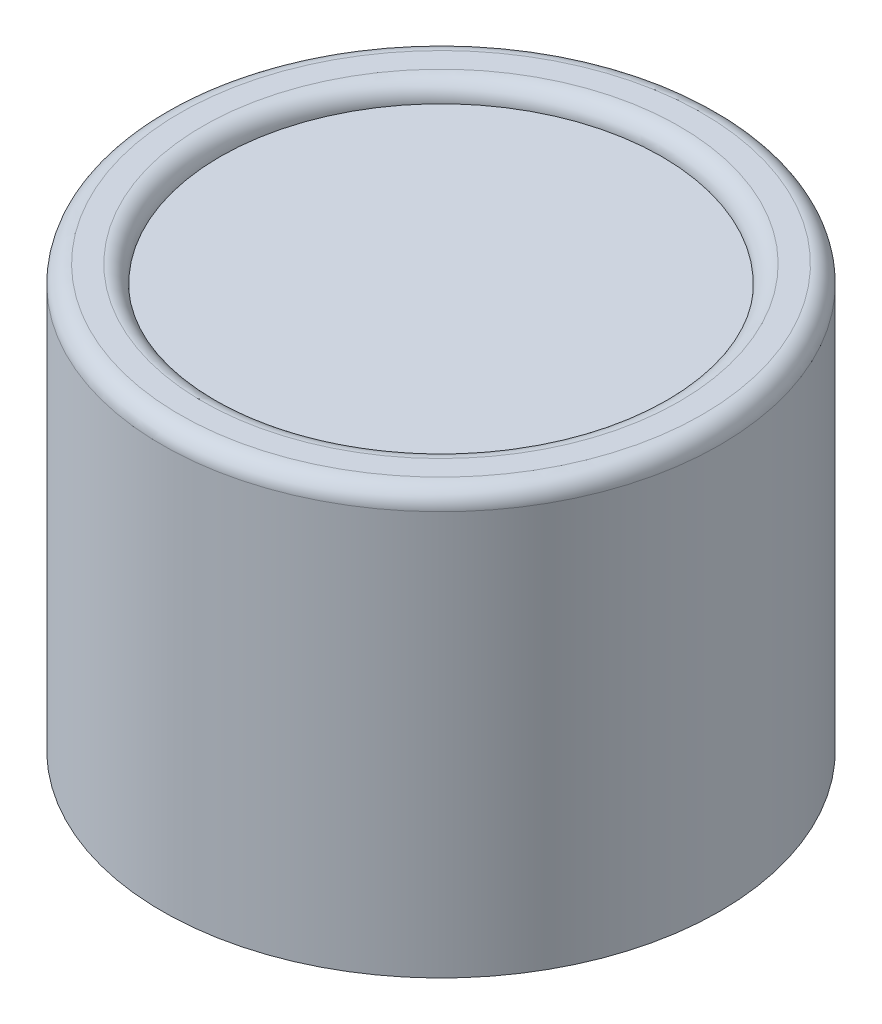
ISO-10303-21;
HEADER;
FILE_DESCRIPTION(('STEP AP214'),'2;1');
FILE_NAME('part.step','',(''),(''),'','','');
FILE_SCHEMA(('AUTOMOTIVE_DESIGN { 1 0 10303 214 1 1 1 1 }'));
ENDSEC;
DATA;
#1=APPLICATION_CONTEXT('core data for automotive mechanical design processes');
#2=APPLICATION_PROTOCOL_DEFINITION('international standard','automotive_design',2000,#1);
#3=PRODUCT_CONTEXT('',#1,'mechanical');
#4=PRODUCT('Part','Part','',(#3));
#5=PRODUCT_RELATED_PRODUCT_CATEGORY('part','',(#4));
#6=PRODUCT_DEFINITION_FORMATION('','',#4);
#7=PRODUCT_DEFINITION_CONTEXT('part definition',#1,'design');
#8=PRODUCT_DEFINITION('design','',#6,#7);
#9=PRODUCT_DEFINITION_SHAPE('','',#8);
#10=(LENGTH_UNIT() NAMED_UNIT(*) SI_UNIT(.MILLI.,.METRE.));
#11=(NAMED_UNIT(*) PLANE_ANGLE_UNIT() SI_UNIT($,.RADIAN.));
#12=(NAMED_UNIT(*) SI_UNIT($,.STERADIAN.) SOLID_ANGLE_UNIT());
#13=UNCERTAINTY_MEASURE_WITH_UNIT(LENGTH_MEASURE(1.E-05),#10,'distance_accuracy_value','');
#14=(GEOMETRIC_REPRESENTATION_CONTEXT(3) GLOBAL_UNCERTAINTY_ASSIGNED_CONTEXT((#13)) GLOBAL_UNIT_ASSIGNED_CONTEXT((#10,
#11,#12)) REPRESENTATION_CONTEXT('',''));
#15=CARTESIAN_POINT('',(0.,0.,0.));
#16=DIRECTION('',(0.,0.,1.));
#17=DIRECTION('',(1.,0.,0.));
#18=AXIS2_PLACEMENT_3D('',#15,#16,#17);
#19=CARTESIAN_POINT('',(6.29,0.,0.));
#20=DIRECTION('',(0.,-1.,0.));
#21=DIRECTION('',(1.,0.,0.));
#22=AXIS2_PLACEMENT_3D('',#19,#20,#21);
#23=PLANE('',#22);
#24=CARTESIAN_POINT('',(0.,0.,0.));
#25=DIRECTION('',(0.,1.,0.));
#26=DIRECTION('',(-1.,0.,0.));
#27=AXIS2_PLACEMENT_3D('',#24,#25,#26);
#28=CIRCLE('',#27,6.29);
#29=CARTESIAN_POINT('',(-6.29,0.,0.));
#30=VERTEX_POINT('',#29);
#31=EDGE_CURVE('E34',#30,#30,#28,.T.);
#32=ORIENTED_EDGE('',*,*,#31,.T.);
#33=EDGE_LOOP('',(#32));
#34=FACE_BOUND('',#33,.T.);
#35=ADVANCED_FACE('F14',(#34),#23,.F.);
#36=CARTESIAN_POINT('',(0.,-11.5,0.));
#37=DIRECTION('',(0.,1.,0.));
#38=DIRECTION('',(-1.,0.,0.));
#39=AXIS2_PLACEMENT_3D('',#36,#37,#38);
#40=PLANE('',#39);
#41=CARTESIAN_POINT('',(0.,-11.5,0.));
#42=DIRECTION('',(0.,1.,0.));
#43=DIRECTION('',(-1.,0.,0.));
#44=AXIS2_PLACEMENT_3D('',#41,#42,#43);
#45=CIRCLE('',#44,7.94);
#46=CARTESIAN_POINT('',(-7.94,-11.5,0.));
#47=VERTEX_POINT('',#46);
#48=EDGE_CURVE('E29',#47,#47,#45,.T.);
#49=ORIENTED_EDGE('',*,*,#48,.F.);
#50=EDGE_LOOP('',(#49));
#51=FACE_BOUND('',#50,.T.);
#52=ADVANCED_FACE('F54',(#51),#40,.F.);
#53=CARTESIAN_POINT('',(0.,0.,0.));
#54=DIRECTION('',(0.,1.,0.));
#55=DIRECTION('',(-1.,0.,0.));
#56=AXIS2_PLACEMENT_3D('',#53,#54,#55);
#57=CYLINDRICAL_SURFACE('',#56,7.94);
#58=CARTESIAN_POINT('',(0.,0.,0.));
#59=DIRECTION('',(0.,-1.,0.));
#60=DIRECTION('',(1.,0.,0.));
#61=AXIS2_PLACEMENT_3D('',#58,#59,#60);
#62=CIRCLE('',#61,7.94);
#63=CARTESIAN_POINT('',(7.94,0.,0.));
#64=VERTEX_POINT('',#63);
#65=EDGE_CURVE('E10',#64,#64,#62,.T.);
#66=ORIENTED_EDGE('',*,*,#65,.T.);
#67=EDGE_LOOP('',(#66));
#68=FACE_BOUND('',#67,.T.);
#69=ORIENTED_EDGE('',*,*,#48,.T.);
#70=EDGE_LOOP('',(#69));
#71=FACE_BOUND('',#70,.T.);
#72=ADVANCED_FACE('F50',(#68,#71),#57,.T.);
#73=CARTESIAN_POINT('',(7.94,0.5,0.));
#74=DIRECTION('',(0.,-1.,0.));
#75=DIRECTION('',(1.,0.,0.));
#76=AXIS2_PLACEMENT_3D('',#73,#74,#75);
#77=PLANE('',#76);
#78=CARTESIAN_POINT('',(0.,0.5,0.));
#79=DIRECTION('',(0.,-1.,0.));
#80=DIRECTION('',(1.,0.,0.));
#81=AXIS2_PLACEMENT_3D('',#78,#79,#80);
#82=CIRCLE('',#81,6.79);
#83=CARTESIAN_POINT('',(6.79,0.500000000000001,0.));
#84=VERTEX_POINT('',#83);
#85=EDGE_CURVE('E21',#84,#84,#82,.T.);
#86=ORIENTED_EDGE('',*,*,#85,.T.);
#87=EDGE_LOOP('',(#86));
#88=FACE_BOUND('',#87,.T.);
#89=CARTESIAN_POINT('',(0.,0.5,0.));
#90=DIRECTION('',(0.,-1.,0.));
#91=DIRECTION('',(1.,0.,0.));
#92=AXIS2_PLACEMENT_3D('',#89,#90,#91);
#93=CIRCLE('',#92,7.44);
#94=CARTESIAN_POINT('',(7.44,0.500000000000001,0.));
#95=VERTEX_POINT('',#94);
#96=EDGE_CURVE('E25',#95,#95,#93,.F.);
#97=ORIENTED_EDGE('',*,*,#96,.T.);
#98=EDGE_LOOP('',(#97));
#99=FACE_BOUND('',#98,.T.);
#100=ADVANCED_FACE('F41',(#88,#99),#77,.F.);
#101=CARTESIAN_POINT('',(0.,0.,0.));
#102=DIRECTION('',(0.,-1.,0.));
#103=DIRECTION('',(1.,0.,0.));
#104=AXIS2_PLACEMENT_3D('',#101,#102,#103);
#105=TOROIDAL_SURFACE('',#104,6.79,0.5);
#106=ORIENTED_EDGE('',*,*,#85,.F.);
#107=EDGE_LOOP('',(#106));
#108=FACE_BOUND('',#107,.T.);
#109=ORIENTED_EDGE('',*,*,#31,.F.);
#110=EDGE_LOOP('',(#109));
#111=FACE_BOUND('',#110,.T.);
#112=ADVANCED_FACE('F39',(#108,#111),#105,.T.);
#113=CARTESIAN_POINT('',(0.,0.,0.));
#114=DIRECTION('',(0.,-1.,0.));
#115=DIRECTION('',(1.,0.,0.));
#116=AXIS2_PLACEMENT_3D('',#113,#114,#115);
#117=TOROIDAL_SURFACE('',#116,7.44,0.5);
#118=ORIENTED_EDGE('',*,*,#65,.F.);
#119=EDGE_LOOP('',(#118));
#120=FACE_BOUND('',#119,.T.);
#121=ORIENTED_EDGE('',*,*,#96,.F.);
#122=EDGE_LOOP('',(#121));
#123=FACE_BOUND('',#122,.T.);
#124=ADVANCED_FACE('F16',(#120,#123),#117,.T.);
#125=CLOSED_SHELL('',(#35,#52,#72,#100,#112,#124));
#126=MANIFOLD_SOLID_BREP('B1',#125);
#127=ADVANCED_BREP_SHAPE_REPRESENTATION('',(#18,#126),#14);
#128=SHAPE_DEFINITION_REPRESENTATION(#9,#127);
ENDSEC;
END-ISO-10303-21;
